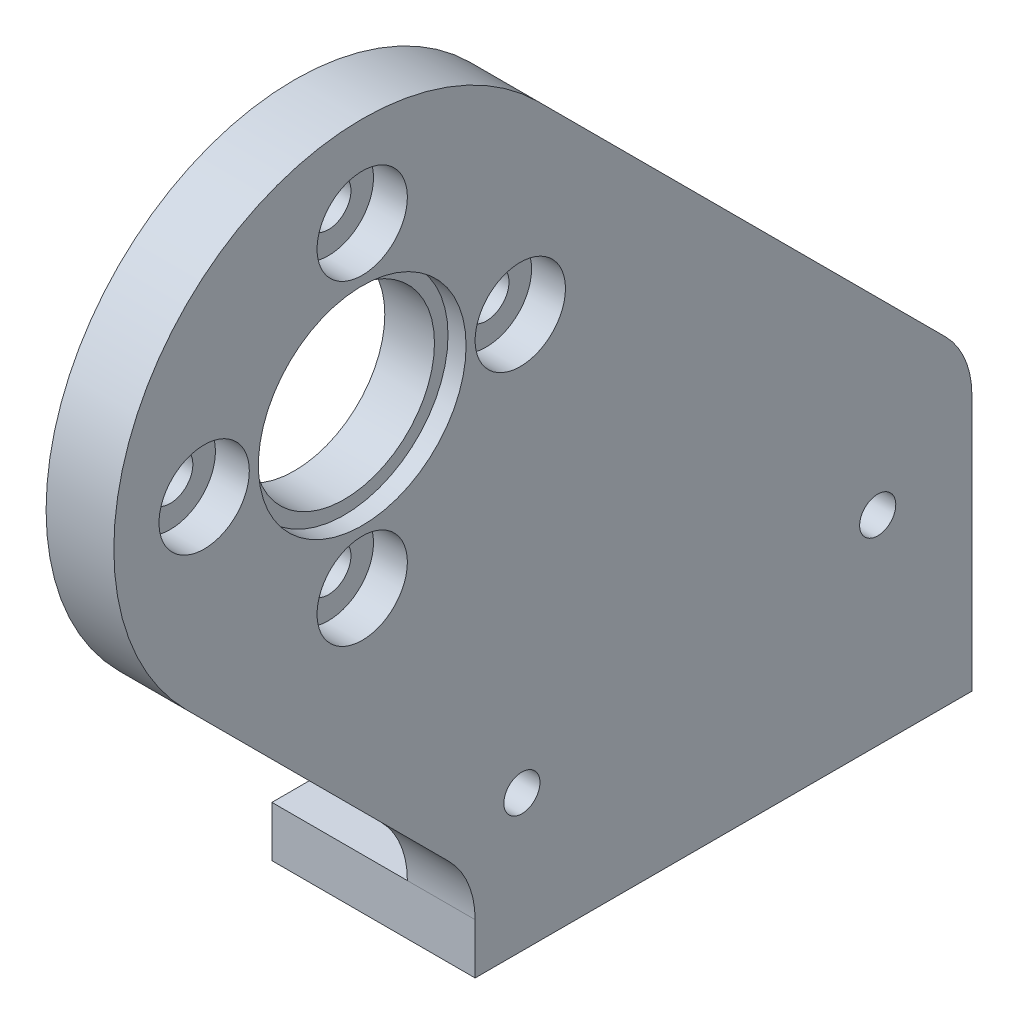
ISO-10303-21;
HEADER;
FILE_DESCRIPTION(('STEP AP214'),'2;1');
FILE_NAME('part.step','',(''),(''),'','','');
FILE_SCHEMA(('AUTOMOTIVE_DESIGN { 1 0 10303 214 1 1 1 1 }'));
ENDSEC;
DATA;
#1=APPLICATION_CONTEXT('core data for automotive mechanical design processes');
#2=APPLICATION_PROTOCOL_DEFINITION('international standard','automotive_design',2000,#1);
#3=PRODUCT_CONTEXT('',#1,'mechanical');
#4=PRODUCT('Part','Part','',(#3));
#5=PRODUCT_RELATED_PRODUCT_CATEGORY('part','',(#4));
#6=PRODUCT_DEFINITION_FORMATION('','',#4);
#7=PRODUCT_DEFINITION_CONTEXT('part definition',#1,'design');
#8=PRODUCT_DEFINITION('design','',#6,#7);
#9=PRODUCT_DEFINITION_SHAPE('','',#8);
#10=(LENGTH_UNIT() NAMED_UNIT(*) SI_UNIT(.MILLI.,.METRE.));
#11=(NAMED_UNIT(*) PLANE_ANGLE_UNIT() SI_UNIT($,.RADIAN.));
#12=(NAMED_UNIT(*) SI_UNIT($,.STERADIAN.) SOLID_ANGLE_UNIT());
#13=UNCERTAINTY_MEASURE_WITH_UNIT(LENGTH_MEASURE(1.E-05),#10,'distance_accuracy_value','');
#14=(GEOMETRIC_REPRESENTATION_CONTEXT(3) GLOBAL_UNCERTAINTY_ASSIGNED_CONTEXT((#13)) GLOBAL_UNIT_ASSIGNED_CONTEXT((#10,
#11,#12)) REPRESENTATION_CONTEXT('',''));
#15=CARTESIAN_POINT('',(0.,0.,0.));
#16=DIRECTION('',(0.,0.,1.));
#17=DIRECTION('',(1.,0.,0.));
#18=AXIS2_PLACEMENT_3D('',#15,#16,#17);
#19=CARTESIAN_POINT('',(69.5,-12.7999999999999,20.9999999999999));
#20=DIRECTION('',(-1.,0.,0.));
#21=DIRECTION('',(0.,0.,1.));
#22=AXIS2_PLACEMENT_3D('',#19,#20,#21);
#23=CYLINDRICAL_SURFACE('',#22,1.);
#24=CARTESIAN_POINT('',(60.,-12.7999999999999,20.9999999999999));
#25=DIRECTION('',(1.,0.,0.));
#26=DIRECTION('',(0.,0.,-1.));
#27=AXIS2_PLACEMENT_3D('',#24,#25,#26);
#28=CIRCLE('',#27,1.);
#29=CARTESIAN_POINT('',(60.,-12.7999999999999,19.9999999999999));
#30=VERTEX_POINT('',#29);
#31=EDGE_CURVE('E42',#30,#30,#28,.F.);
#32=ORIENTED_EDGE('',*,*,#31,.F.);
#33=EDGE_LOOP('',(#32));
#34=FACE_BOUND('',#33,.T.);
#35=CARTESIAN_POINT('',(58.5,-12.7999999999999,20.9999999999999));
#36=DIRECTION('',(-1.,0.,0.));
#37=DIRECTION('',(0.,0.,1.));
#38=AXIS2_PLACEMENT_3D('',#35,#36,#37);
#39=CIRCLE('',#38,1.);
#40=CARTESIAN_POINT('',(58.5,-12.7999999999999,21.9999999999999));
#41=VERTEX_POINT('',#40);
#42=EDGE_CURVE('E269',#41,#41,#39,.T.);
#43=ORIENTED_EDGE('',*,*,#42,.T.);
#44=EDGE_LOOP('',(#43));
#45=FACE_BOUND('',#44,.T.);
#46=ADVANCED_FACE('F38',(#34,#45),#23,.F.);
#47=CARTESIAN_POINT('',(69.5,-5.8,28.));
#48=DIRECTION('',(-1.,0.,0.));
#49=DIRECTION('',(0.,0.,1.));
#50=AXIS2_PLACEMENT_3D('',#47,#48,#49);
#51=CYLINDRICAL_SURFACE('',#50,1.);
#52=CARTESIAN_POINT('',(60.,-5.8,28.));
#53=DIRECTION('',(1.,0.,0.));
#54=DIRECTION('',(0.,0.,-1.));
#55=AXIS2_PLACEMENT_3D('',#52,#53,#54);
#56=CIRCLE('',#55,1.);
#57=CARTESIAN_POINT('',(60.,-5.8,27.));
#58=VERTEX_POINT('',#57);
#59=EDGE_CURVE('E254',#58,#58,#56,.F.);
#60=ORIENTED_EDGE('',*,*,#59,.F.);
#61=EDGE_LOOP('',(#60));
#62=FACE_BOUND('',#61,.T.);
#63=CARTESIAN_POINT('',(58.5,-5.8,28.));
#64=DIRECTION('',(-1.,0.,0.));
#65=DIRECTION('',(0.,0.,1.));
#66=AXIS2_PLACEMENT_3D('',#63,#64,#65);
#67=CIRCLE('',#66,1.);
#68=CARTESIAN_POINT('',(58.5,-5.8,29.));
#69=VERTEX_POINT('',#68);
#70=EDGE_CURVE('E271',#69,#69,#67,.T.);
#71=ORIENTED_EDGE('',*,*,#70,.T.);
#72=EDGE_LOOP('',(#71));
#73=FACE_BOUND('',#72,.T.);
#74=ADVANCED_FACE('F265',(#62,#73),#51,.F.);
#75=CARTESIAN_POINT('',(69.5,1.20000000000005,21.));
#76=DIRECTION('',(-1.,0.,0.));
#77=DIRECTION('',(0.,0.,1.));
#78=AXIS2_PLACEMENT_3D('',#75,#76,#77);
#79=CYLINDRICAL_SURFACE('',#78,1.);
#80=CARTESIAN_POINT('',(60.,1.20000000000005,21.));
#81=DIRECTION('',(1.,0.,0.));
#82=DIRECTION('',(0.,0.,-1.));
#83=AXIS2_PLACEMENT_3D('',#80,#81,#82);
#84=CIRCLE('',#83,1.);
#85=CARTESIAN_POINT('',(60.,1.20000000000005,20.));
#86=VERTEX_POINT('',#85);
#87=EDGE_CURVE('E154',#86,#86,#84,.F.);
#88=ORIENTED_EDGE('',*,*,#87,.F.);
#89=EDGE_LOOP('',(#88));
#90=FACE_BOUND('',#89,.T.);
#91=CARTESIAN_POINT('',(58.5,1.20000000000005,21.));
#92=DIRECTION('',(-1.,0.,0.));
#93=DIRECTION('',(0.,0.,1.));
#94=AXIS2_PLACEMENT_3D('',#91,#92,#93);
#95=CIRCLE('',#94,1.);
#96=CARTESIAN_POINT('',(58.5,1.20000000000005,22.));
#97=VERTEX_POINT('',#96);
#98=EDGE_CURVE('E275',#97,#97,#95,.T.);
#99=ORIENTED_EDGE('',*,*,#98,.T.);
#100=EDGE_LOOP('',(#99));
#101=FACE_BOUND('',#100,.T.);
#102=ADVANCED_FACE('F395',(#90,#101),#79,.F.);
#103=CARTESIAN_POINT('',(69.5,-5.79999999999995,14.));
#104=DIRECTION('',(-1.,0.,0.));
#105=DIRECTION('',(0.,0.,1.));
#106=AXIS2_PLACEMENT_3D('',#103,#104,#105);
#107=CYLINDRICAL_SURFACE('',#106,1.);
#108=CARTESIAN_POINT('',(60.,-5.79999999999995,14.));
#109=DIRECTION('',(1.,0.,0.));
#110=DIRECTION('',(0.,0.,-1.));
#111=AXIS2_PLACEMENT_3D('',#108,#109,#110);
#112=CIRCLE('',#111,1.);
#113=CARTESIAN_POINT('',(60.,-5.79999999999995,13.));
#114=VERTEX_POINT('',#113);
#115=EDGE_CURVE('E172',#114,#114,#112,.F.);
#116=ORIENTED_EDGE('',*,*,#115,.F.);
#117=EDGE_LOOP('',(#116));
#118=FACE_BOUND('',#117,.T.);
#119=CARTESIAN_POINT('',(58.5,-5.79999999999995,14.));
#120=DIRECTION('',(-1.,0.,0.));
#121=DIRECTION('',(0.,0.,1.));
#122=AXIS2_PLACEMENT_3D('',#119,#120,#121);
#123=CIRCLE('',#122,1.);
#124=CARTESIAN_POINT('',(58.5,-5.79999999999995,15.));
#125=VERTEX_POINT('',#124);
#126=EDGE_CURVE('E284',#125,#125,#123,.T.);
#127=ORIENTED_EDGE('',*,*,#126,.T.);
#128=EDGE_LOOP('',(#127));
#129=FACE_BOUND('',#128,.T.);
#130=ADVANCED_FACE('F398',(#118,#129),#107,.F.);
#131=CARTESIAN_POINT('',(60.5,-5.79999999999995,21.));
#132=DIRECTION('',(-1.,0.,0.));
#133=DIRECTION('',(0.,0.,-1.));
#134=AXIS2_PLACEMENT_3D('',#131,#132,#133);
#135=CYLINDRICAL_SURFACE('',#134,4.);
#136=CARTESIAN_POINT('',(60.7,-5.79999999999995,21.));
#137=DIRECTION('',(1.,0.,0.));
#138=DIRECTION('',(0.,0.,-1.));
#139=AXIS2_PLACEMENT_3D('',#136,#137,#138);
#140=CIRCLE('',#139,4.);
#141=CARTESIAN_POINT('',(60.7,-5.79999999999995,17.));
#142=VERTEX_POINT('',#141);
#143=EDGE_CURVE('E179',#142,#142,#140,.F.);
#144=ORIENTED_EDGE('',*,*,#143,.F.);
#145=EDGE_LOOP('',(#144));
#146=FACE_BOUND('',#145,.T.);
#147=CARTESIAN_POINT('',(58.5,-5.79999999999995,21.));
#148=DIRECTION('',(-1.,0.,0.));
#149=DIRECTION('',(0.,0.,1.));
#150=AXIS2_PLACEMENT_3D('',#147,#148,#149);
#151=CIRCLE('',#150,4.);
#152=CARTESIAN_POINT('',(58.5,-5.79999999999995,25.));
#153=VERTEX_POINT('',#152);
#154=EDGE_CURVE('E287',#153,#153,#151,.T.);
#155=ORIENTED_EDGE('',*,*,#154,.T.);
#156=EDGE_LOOP('',(#155));
#157=FACE_BOUND('',#156,.T.);
#158=ADVANCED_FACE('F405',(#146,#157),#135,.F.);
#159=CARTESIAN_POINT('',(61.61096680392,-28.0132034356,20.));
#160=DIRECTION('',(-1.,0.,0.));
#161=DIRECTION('',(0.,-0.707106781186548,0.707106781186548));
#162=AXIS2_PLACEMENT_3D('',#159,#160,#161);
#163=CYLINDRICAL_SURFACE('',#162,4.);
#164=DIRECTION('',(-1.,0.,0.));
#165=VECTOR('',#164,1.);
#166=CARTESIAN_POINT('',(61.5,-25.18477631085,17.171572875254));
#167=LINE('',#166,#165);
#168=CARTESIAN_POINT('',(61.5,-25.18477631085,17.171572875254));
#169=VERTEX_POINT('',#168);
#170=CARTESIAN_POINT('',(58.5,-25.1847763108514,17.1715728752554));
#171=VERTEX_POINT('',#170);
#172=EDGE_CURVE('E117',#169,#171,#167,.T.);
#173=ORIENTED_EDGE('',*,*,#172,.T.);
#174=CARTESIAN_POINT('',(58.5,-28.0132034356,20.));
#175=DIRECTION('',(1.,0.,0.));
#176=DIRECTION('',(0.,0.,1.));
#177=AXIS2_PLACEMENT_3D('',#174,#175,#176);
#178=CIRCLE('',#177,4.00000000000064);
#179=CARTESIAN_POINT('',(58.5,-28.0132034356,16.));
#180=VERTEX_POINT('',#179);
#181=EDGE_CURVE('E120',#180,#171,#178,.T.);
#182=ORIENTED_EDGE('',*,*,#181,.F.);
#183=DIRECTION('',(-1.,0.,0.));
#184=VECTOR('',#183,1.);
#185=CARTESIAN_POINT('',(61.54773426501,-28.0132034356,16.));
#186=LINE('',#185,#184);
#187=CARTESIAN_POINT('',(61.5,-28.0132034356,16.));
#188=VERTEX_POINT('',#187);
#189=EDGE_CURVE('E55',#188,#180,#186,.T.);
#190=ORIENTED_EDGE('',*,*,#189,.F.);
#191=CARTESIAN_POINT('',(61.5,-28.0132034356,20.));
#192=DIRECTION('',(-1.,0.,0.));
#193=DIRECTION('',(0.,0.707106781186548,-0.707106781186548));
#194=AXIS2_PLACEMENT_3D('',#191,#192,#193);
#195=CIRCLE('',#194,4.);
#196=EDGE_CURVE('E11',#169,#188,#195,.T.);
#197=ORIENTED_EDGE('',*,*,#196,.F.);
#198=EDGE_LOOP('',(#173,#182,#190,#197));
#199=FACE_BOUND('',#198,.T.);
#200=ADVANCED_FACE('F119',(#199),#163,.F.);
#201=CARTESIAN_POINT('',(60.93933982822,-28.86066017178,-6.));
#202=DIRECTION('',(0.,0.,-1.));
#203=DIRECTION('',(1.,0.,0.));
#204=AXIS2_PLACEMENT_3D('',#201,#202,#203);
#205=PLANE('',#204);
#206=DIRECTION('',(0.,-1.,2.95824592404915E-13));
#207=VECTOR('',#206,1.);
#208=CARTESIAN_POINT('',(58.5,-18.90050506339,-6.00000000000269));
#209=LINE('',#208,#207);
#210=CARTESIAN_POINT('',(58.5,-18.90050506339,-6.00000000000404));
#211=VERTEX_POINT('',#210);
#212=CARTESIAN_POINT('',(58.5,-28.0132034356,-6.));
#213=VERTEX_POINT('',#212);
#214=EDGE_CURVE('E290',#211,#213,#209,.T.);
#215=ORIENTED_EDGE('',*,*,#214,.F.);
#216=DIRECTION('',(1.,0.,0.));
#217=VECTOR('',#216,1.);
#218=CARTESIAN_POINT('',(59.5,-18.90050506339,-6.));
#219=LINE('',#218,#217);
#220=CARTESIAN_POINT('',(61.5,-18.90050506339,-6.));
#221=VERTEX_POINT('',#220);
#222=EDGE_CURVE('E125',#211,#221,#219,.T.);
#223=ORIENTED_EDGE('',*,*,#222,.T.);
#224=DIRECTION('',(0.,1.,0.));
#225=VECTOR('',#224,1.);
#226=CARTESIAN_POINT('',(61.5,-27.8,-6.));
#227=LINE('',#226,#225);
#228=CARTESIAN_POINT('',(61.5,-30.2494897427832,-6.));
#229=VERTEX_POINT('',#228);
#230=EDGE_CURVE('E47',#229,#221,#227,.T.);
#231=ORIENTED_EDGE('',*,*,#230,.F.);
#232=DIRECTION('',(-1.,0.,0.));
#233=VECTOR('',#232,1.);
#234=CARTESIAN_POINT('',(83.6415947150705,-30.2494897427832,-6.));
#235=LINE('',#234,#233);
#236=CARTESIAN_POINT('',(52.5,-30.2494897427832,-6.));
#237=VERTEX_POINT('',#236);
#238=EDGE_CURVE('E210',#229,#237,#235,.T.);
#239=ORIENTED_EDGE('',*,*,#238,.T.);
#240=DIRECTION('',(0.,-1.,0.));
#241=VECTOR('',#240,1.);
#242=CARTESIAN_POINT('',(52.5,-30.2494897427832,-6.));
#243=LINE('',#242,#241);
#244=CARTESIAN_POINT('',(52.5,-28.0132034356,-6.));
#245=VERTEX_POINT('',#244);
#246=EDGE_CURVE('E198',#245,#237,#243,.T.);
#247=ORIENTED_EDGE('',*,*,#246,.F.);
#248=DIRECTION('',(1.,0.,0.));
#249=VECTOR('',#248,1.);
#250=CARTESIAN_POINT('',(52.5,-28.0132034356,-6.));
#251=LINE('',#250,#249);
#252=EDGE_CURVE('E208',#245,#213,#251,.T.);
#253=ORIENTED_EDGE('',*,*,#252,.T.);
#254=EDGE_LOOP('',(#215,#223,#231,#239,#247,#253));
#255=FACE_BOUND('',#254,.T.);
#256=ADVANCED_FACE('F294',(#255),#205,.T.);
#257=CARTESIAN_POINT('',(60.93933982822,-28.86066017178,16.));
#258=DIRECTION('',(0.,0.,1.));
#259=DIRECTION('',(0.,1.,0.));
#260=AXIS2_PLACEMENT_3D('',#257,#258,#259);
#261=PLANE('',#260);
#262=ORIENTED_EDGE('',*,*,#189,.T.);
#263=DIRECTION('',(1.,0.,0.));
#264=VECTOR('',#263,1.);
#265=CARTESIAN_POINT('',(52.5,-28.0132034356,16.));
#266=LINE('',#265,#264);
#267=CARTESIAN_POINT('',(52.5,-28.0132034356,16.));
#268=VERTEX_POINT('',#267);
#269=EDGE_CURVE('E206',#268,#180,#266,.T.);
#270=ORIENTED_EDGE('',*,*,#269,.F.);
#271=DIRECTION('',(0.,1.,0.));
#272=VECTOR('',#271,1.);
#273=CARTESIAN_POINT('',(52.5,-28.0132034356,16.));
#274=LINE('',#273,#272);
#275=CARTESIAN_POINT('',(52.5,-30.2494897427832,16.));
#276=VERTEX_POINT('',#275);
#277=EDGE_CURVE('E204',#276,#268,#274,.T.);
#278=ORIENTED_EDGE('',*,*,#277,.F.);
#279=DIRECTION('',(-1.,0.,0.));
#280=VECTOR('',#279,1.);
#281=CARTESIAN_POINT('',(83.6415947150705,-30.2494897427832,16.));
#282=LINE('',#281,#280);
#283=CARTESIAN_POINT('',(61.5,-30.2494897427832,16.));
#284=VERTEX_POINT('',#283);
#285=EDGE_CURVE('E211',#284,#276,#282,.T.);
#286=ORIENTED_EDGE('',*,*,#285,.F.);
#287=DIRECTION('',(0.,1.,0.));
#288=VECTOR('',#287,1.);
#289=CARTESIAN_POINT('',(61.5,-28.86066017178,16.));
#290=LINE('',#289,#288);
#291=EDGE_CURVE('E213',#284,#188,#290,.T.);
#292=ORIENTED_EDGE('',*,*,#291,.T.);
#293=EDGE_LOOP('',(#262,#270,#278,#286,#292));
#294=FACE_BOUND('',#293,.T.);
#295=ADVANCED_FACE('F302',(#294),#261,.T.);
#296=CARTESIAN_POINT('',(61.5,-27.8,32.));
#297=DIRECTION('',(1.,0.,0.));
#298=DIRECTION('',(0.,-1.,0.));
#299=AXIS2_PLACEMENT_3D('',#296,#297,#298);
#300=PLANE('',#299);
#301=CARTESIAN_POINT('',(61.5,-12.7999999999999,20.9999999999999));
#302=DIRECTION('',(1.,0.,0.));
#303=DIRECTION('',(0.,0.,-1.));
#304=AXIS2_PLACEMENT_3D('',#301,#302,#303);
#305=CIRCLE('',#304,2.);
#306=CARTESIAN_POINT('',(61.5,-12.7999999999999,18.9999999999999));
#307=VERTEX_POINT('',#306);
#308=EDGE_CURVE('E155',#307,#307,#305,.T.);
#309=ORIENTED_EDGE('',*,*,#308,.F.);
#310=EDGE_LOOP('',(#309));
#311=FACE_BOUND('',#310,.T.);
#312=CARTESIAN_POINT('',(61.5,-5.8,28.));
#313=DIRECTION('',(1.,0.,0.));
#314=DIRECTION('',(0.,0.,-1.));
#315=AXIS2_PLACEMENT_3D('',#312,#313,#314);
#316=CIRCLE('',#315,2.);
#317=CARTESIAN_POINT('',(61.5,-5.8,26.));
#318=VERTEX_POINT('',#317);
#319=EDGE_CURVE('E161',#318,#318,#316,.T.);
#320=ORIENTED_EDGE('',*,*,#319,.F.);
#321=EDGE_LOOP('',(#320));
#322=FACE_BOUND('',#321,.T.);
#323=CARTESIAN_POINT('',(61.5,1.20000000000005,21.));
#324=DIRECTION('',(1.,0.,0.));
#325=DIRECTION('',(0.,0.,-1.));
#326=AXIS2_PLACEMENT_3D('',#323,#324,#325);
#327=CIRCLE('',#326,2.);
#328=CARTESIAN_POINT('',(61.5,1.20000000000005,19.));
#329=VERTEX_POINT('',#328);
#330=EDGE_CURVE('E150',#329,#329,#327,.T.);
#331=ORIENTED_EDGE('',*,*,#330,.F.);
#332=EDGE_LOOP('',(#331));
#333=FACE_BOUND('',#332,.T.);
#334=CARTESIAN_POINT('',(61.5,-5.79999999999995,14.));
#335=DIRECTION('',(1.,0.,0.));
#336=DIRECTION('',(0.,0.,-1.));
#337=AXIS2_PLACEMENT_3D('',#334,#335,#336);
#338=CIRCLE('',#337,2.);
#339=CARTESIAN_POINT('',(61.5,-5.79999999999995,12.));
#340=VERTEX_POINT('',#339);
#341=EDGE_CURVE('E173',#340,#340,#338,.T.);
#342=ORIENTED_EDGE('',*,*,#341,.F.);
#343=EDGE_LOOP('',(#342));
#344=FACE_BOUND('',#343,.T.);
#345=CARTESIAN_POINT('',(61.5,-5.80000000000003,21.0000000000001));
#346=DIRECTION('',(1.,0.,0.));
#347=DIRECTION('',(0.,0.,-1.));
#348=AXIS2_PLACEMENT_3D('',#345,#346,#347);
#349=CIRCLE('',#348,4.6);
#350=CARTESIAN_POINT('',(61.5,-5.80000000000003,16.4000000000001));
#351=VERTEX_POINT('',#350);
#352=EDGE_CURVE('E180',#351,#351,#349,.T.);
#353=ORIENTED_EDGE('',*,*,#352,.F.);
#354=EDGE_LOOP('',(#353));
#355=FACE_BOUND('',#354,.T.);
#356=ORIENTED_EDGE('',*,*,#196,.T.);
#357=ORIENTED_EDGE('',*,*,#291,.F.);
#358=DIRECTION('',(0.,0.,1.));
#359=VECTOR('',#358,1.);
#360=CARTESIAN_POINT('',(61.5,-30.2494897427832,32.));
#361=LINE('',#360,#359);
#362=EDGE_CURVE('E216',#229,#284,#361,.T.);
#363=ORIENTED_EDGE('',*,*,#362,.F.);
#364=ORIENTED_EDGE('',*,*,#230,.T.);
#365=CARTESIAN_POINT('',(61.5,-18.90050506339,-2.));
#366=DIRECTION('',(1.,0.,0.));
#367=DIRECTION('',(0.,0.,-1.));
#368=AXIS2_PLACEMENT_3D('',#365,#366,#367);
#369=CIRCLE('',#368,4.);
#370=CARTESIAN_POINT('',(61.5,-16.07207793864,-4.82842712475));
#371=VERTEX_POINT('',#370);
#372=EDGE_CURVE('E228',#221,#371,#369,.T.);
#373=ORIENTED_EDGE('',*,*,#372,.T.);
#374=DIRECTION('',(0.,-0.707106781186548,-0.707106781186548));
#375=VECTOR('',#374,1.);
#376=CARTESIAN_POINT('',(61.5,1.97817459305205,13.221825406948));
#377=LINE('',#376,#375);
#378=CARTESIAN_POINT('',(61.5,1.97817459305205,13.221825406948));
#379=VERTEX_POINT('',#378);
#380=EDGE_CURVE('E220',#379,#371,#377,.T.);
#381=ORIENTED_EDGE('',*,*,#380,.F.);
#382=CARTESIAN_POINT('',(61.5,-5.79999999999998,21.));
#383=DIRECTION('',(-1.,0.,0.));
#384=DIRECTION('',(0.,0.745298433795883,-0.666731013663985));
#385=AXIS2_PLACEMENT_3D('',#382,#383,#384);
#386=CIRCLE('',#385,11.);
#387=CARTESIAN_POINT('',(61.5,-13.578174593052,28.778174593052));
#388=VERTEX_POINT('',#387);
#389=EDGE_CURVE('E223',#388,#379,#386,.T.);
#390=ORIENTED_EDGE('',*,*,#389,.F.);
#391=DIRECTION('',(0.,0.707106781186548,0.707106781186548));
#392=VECTOR('',#391,1.);
#393=CARTESIAN_POINT('',(61.5,-25.18477631085,17.171572875254));
#394=LINE('',#393,#392);
#395=EDGE_CURVE('E124',#169,#388,#394,.T.);
#396=ORIENTED_EDGE('',*,*,#395,.F.);
#397=EDGE_LOOP('',(#356,#357,#363,#364,#373,#381,#390,#396));
#398=FACE_BOUND('',#397,.T.);
#399=CARTESIAN_POINT('',(61.5,-24.18477631085,13.928932188135));
#400=DIRECTION('',(-1.,0.,0.));
#401=DIRECTION('',(0.,-1.,0.));
#402=AXIS2_PLACEMENT_3D('',#399,#400,#401);
#403=CIRCLE('',#402,0.8);
#404=CARTESIAN_POINT('',(61.5,-24.98477631085,13.928932188135));
#405=VERTEX_POINT('',#404);
#406=EDGE_CURVE('E231',#405,#405,#403,.T.);
#407=ORIENTED_EDGE('',*,*,#406,.T.);
#408=EDGE_LOOP('',(#407));
#409=FACE_BOUND('',#408,.T.);
#410=CARTESIAN_POINT('',(61.5,-21.40640546818,-1.82799186006));
#411=DIRECTION('',(-1.,0.,0.));
#412=DIRECTION('',(0.,-1.,0.));
#413=AXIS2_PLACEMENT_3D('',#410,#411,#412);
#414=CIRCLE('',#413,0.8);
#415=CARTESIAN_POINT('',(61.5,-22.20640546818,-1.82799186006));
#416=VERTEX_POINT('',#415);
#417=EDGE_CURVE('E234',#416,#416,#414,.T.);
#418=ORIENTED_EDGE('',*,*,#417,.T.);
#419=EDGE_LOOP('',(#418));
#420=FACE_BOUND('',#419,.T.);
#421=ADVANCED_FACE('F304',(#311,#322,#333,#344,#355,#398,#409,#420),#300,.T.);
#422=CARTESIAN_POINT('',(59.40518465266,-18.90050506339,-2.));
#423=DIRECTION('',(1.,0.,0.));
#424=DIRECTION('',(0.,0.,1.));
#425=AXIS2_PLACEMENT_3D('',#422,#423,#424);
#426=CYLINDRICAL_SURFACE('',#425,4.);
#427=ORIENTED_EDGE('',*,*,#222,.F.);
#428=CARTESIAN_POINT('',(58.5,-18.90050506339,-2.));
#429=DIRECTION('',(-1.,0.,0.));
#430=DIRECTION('',(0.,0.,1.));
#431=AXIS2_PLACEMENT_3D('',#428,#429,#430);
#432=CIRCLE('',#431,4.00000000000404);
#433=CARTESIAN_POINT('',(58.5,-16.07207793864,-4.82842712475));
#434=VERTEX_POINT('',#433);
#435=EDGE_CURVE('E147',#434,#211,#432,.T.);
#436=ORIENTED_EDGE('',*,*,#435,.F.);
#437=DIRECTION('',(1.,0.,0.));
#438=VECTOR('',#437,1.);
#439=CARTESIAN_POINT('',(59.5,-16.07207793864,-4.82842712475));
#440=LINE('',#439,#438);
#441=EDGE_CURVE('E222',#434,#371,#440,.T.);
#442=ORIENTED_EDGE('',*,*,#441,.T.);
#443=ORIENTED_EDGE('',*,*,#372,.F.);
#444=EDGE_LOOP('',(#427,#436,#442,#443));
#445=FACE_BOUND('',#444,.T.);
#446=ADVANCED_FACE('F310',(#445),#426,.T.);
#447=CARTESIAN_POINT('',(60.5,-7.63273811042195,3.61091270347));
#448=DIRECTION('',(0.,-0.707106781186548,0.707106781186548));
#449=DIRECTION('',(0.,0.707106781186548,0.707106781186548));
#450=AXIS2_PLACEMENT_3D('',#447,#448,#449);
#451=PLANE('',#450);
#452=ORIENTED_EDGE('',*,*,#441,.F.);
#453=DIRECTION('',(0.,-0.707106781186431,-0.707106781186664));
#454=VECTOR('',#453,1.);
#455=CARTESIAN_POINT('',(58.5,1.97817459305204,13.221825406948));
#456=LINE('',#455,#454);
#457=CARTESIAN_POINT('',(58.5,1.97817459305204,13.221825406948));
#458=VERTEX_POINT('',#457);
#459=EDGE_CURVE('E141',#458,#434,#456,.T.);
#460=ORIENTED_EDGE('',*,*,#459,.F.);
#461=DIRECTION('',(-1.,0.,0.));
#462=VECTOR('',#461,1.);
#463=CARTESIAN_POINT('',(61.5,1.97817459305205,13.221825406948));
#464=LINE('',#463,#462);
#465=EDGE_CURVE('E225',#379,#458,#464,.T.);
#466=ORIENTED_EDGE('',*,*,#465,.F.);
#467=ORIENTED_EDGE('',*,*,#380,.T.);
#468=EDGE_LOOP('',(#452,#460,#466,#467));
#469=FACE_BOUND('',#468,.T.);
#470=ADVANCED_FACE('F432',(#469),#451,.F.);
#471=CARTESIAN_POINT('',(60.5,-5.79999999999998,21.));
#472=DIRECTION('',(-1.,0.,0.));
#473=DIRECTION('',(0.,0.,-1.));
#474=AXIS2_PLACEMENT_3D('',#471,#472,#473);
#475=CYLINDRICAL_SURFACE('',#474,11.);
#476=ORIENTED_EDGE('',*,*,#389,.T.);
#477=ORIENTED_EDGE('',*,*,#465,.T.);
#478=CARTESIAN_POINT('',(58.5,-5.79999999999998,21.));
#479=DIRECTION('',(-1.,0.,0.));
#480=DIRECTION('',(0.,0.,1.));
#481=AXIS2_PLACEMENT_3D('',#478,#479,#480);
#482=CIRCLE('',#481,11.);
#483=CARTESIAN_POINT('',(58.5,-13.578174593052,28.778174593052));
#484=VERTEX_POINT('',#483);
#485=EDGE_CURVE('E139',#484,#458,#482,.T.);
#486=ORIENTED_EDGE('',*,*,#485,.F.);
#487=DIRECTION('',(-1.,0.,0.));
#488=VECTOR('',#487,1.);
#489=CARTESIAN_POINT('',(61.5,-13.578174593052,28.778174593052));
#490=LINE('',#489,#488);
#491=EDGE_CURVE('E138',#388,#484,#490,.T.);
#492=ORIENTED_EDGE('',*,*,#491,.F.);
#493=EDGE_LOOP('',(#476,#477,#486,#492));
#494=FACE_BOUND('',#493,.T.);
#495=ADVANCED_FACE('F436',(#494),#475,.T.);
#496=CARTESIAN_POINT('',(60.5,-19.96726188958,22.389087296526));
#497=DIRECTION('',(0.,0.707106781186548,-0.707106781186548));
#498=DIRECTION('',(0.,-0.707106781186548,-0.707106781186548));
#499=AXIS2_PLACEMENT_3D('',#496,#497,#498);
#500=PLANE('',#499);
#501=ORIENTED_EDGE('',*,*,#491,.T.);
#502=DIRECTION('',(0.,0.707106781186603,0.707106781186492));
#503=VECTOR('',#502,1.);
#504=CARTESIAN_POINT('',(58.5,-25.1847763108509,17.1715728752549));
#505=LINE('',#504,#503);
#506=EDGE_CURVE('E133',#171,#484,#505,.T.);
#507=ORIENTED_EDGE('',*,*,#506,.F.);
#508=ORIENTED_EDGE('',*,*,#172,.F.);
#509=ORIENTED_EDGE('',*,*,#395,.T.);
#510=EDGE_LOOP('',(#501,#507,#508,#509));
#511=FACE_BOUND('',#510,.T.);
#512=ADVANCED_FACE('F136',(#511),#500,.F.);
#513=CARTESIAN_POINT('',(59.65,-24.18477631085,13.928932188135));
#514=DIRECTION('',(-1.,0.,0.));
#515=DIRECTION('',(0.,-1.,0.));
#516=AXIS2_PLACEMENT_3D('',#513,#514,#515);
#517=CONICAL_SURFACE('',#516,0.95,0.7853981625);
#518=CARTESIAN_POINT('',(59.5,-24.18477631085,13.928932188135));
#519=DIRECTION('',(-1.,0.,0.));
#520=DIRECTION('',(0.,0.,1.));
#521=AXIS2_PLACEMENT_3D('',#518,#519,#520);
#522=CIRCLE('',#521,1.1);
#523=CARTESIAN_POINT('',(59.5,-24.18477631085,15.028932188135));
#524=VERTEX_POINT('',#523);
#525=EDGE_CURVE('E278',#524,#524,#522,.T.);
#526=ORIENTED_EDGE('',*,*,#525,.T.);
#527=EDGE_LOOP('',(#526));
#528=FACE_BOUND('',#527,.T.);
#529=CARTESIAN_POINT('',(59.8,-24.18477631085,13.928932188135));
#530=DIRECTION('',(-1.,0.,0.));
#531=DIRECTION('',(0.,1.,0.));
#532=AXIS2_PLACEMENT_3D('',#529,#530,#531);
#533=CIRCLE('',#532,0.8);
#534=CARTESIAN_POINT('',(59.8,-23.38477631085,13.928932188135));
#535=VERTEX_POINT('',#534);
#536=EDGE_CURVE('E244',#535,#535,#533,.T.);
#537=ORIENTED_EDGE('',*,*,#536,.F.);
#538=EDGE_LOOP('',(#537));
#539=FACE_BOUND('',#538,.T.);
#540=ADVANCED_FACE('F316',(#528,#539),#517,.F.);
#541=CARTESIAN_POINT('',(62.10472291998,-24.18477631085,13.928932188135));
#542=DIRECTION('',(-1.,0.,0.));
#543=DIRECTION('',(0.,-1.,0.));
#544=AXIS2_PLACEMENT_3D('',#541,#542,#543);
#545=CYLINDRICAL_SURFACE('',#544,0.8);
#546=ORIENTED_EDGE('',*,*,#536,.T.);
#547=EDGE_LOOP('',(#546));
#548=FACE_BOUND('',#547,.T.);
#549=ORIENTED_EDGE('',*,*,#406,.F.);
#550=EDGE_LOOP('',(#549));
#551=FACE_BOUND('',#550,.T.);
#552=ADVANCED_FACE('F319',(#548,#551),#545,.F.);
#553=CARTESIAN_POINT('',(59.65,-21.40640546818,-1.82799186006));
#554=DIRECTION('',(-1.,0.,0.));
#555=DIRECTION('',(0.,-1.,0.));
#556=AXIS2_PLACEMENT_3D('',#553,#554,#555);
#557=CONICAL_SURFACE('',#556,0.95,0.7853981625);
#558=CARTESIAN_POINT('',(59.5,-21.40640546818,-1.82799186006));
#559=DIRECTION('',(-1.,0.,0.));
#560=DIRECTION('',(0.,0.,1.));
#561=AXIS2_PLACEMENT_3D('',#558,#559,#560);
#562=CIRCLE('',#561,1.1);
#563=CARTESIAN_POINT('',(59.5,-21.40640546818,-0.72799186006));
#564=VERTEX_POINT('',#563);
#565=EDGE_CURVE('E334',#564,#564,#562,.T.);
#566=ORIENTED_EDGE('',*,*,#565,.T.);
#567=EDGE_LOOP('',(#566));
#568=FACE_BOUND('',#567,.T.);
#569=CARTESIAN_POINT('',(59.8,-21.40640546818,-1.82799186006));
#570=DIRECTION('',(-1.,0.,0.));
#571=DIRECTION('',(0.,1.,0.));
#572=AXIS2_PLACEMENT_3D('',#569,#570,#571);
#573=CIRCLE('',#572,0.8);
#574=CARTESIAN_POINT('',(59.8,-20.60640546818,-1.82799186006));
#575=VERTEX_POINT('',#574);
#576=EDGE_CURVE('E219',#575,#575,#573,.T.);
#577=ORIENTED_EDGE('',*,*,#576,.F.);
#578=EDGE_LOOP('',(#577));
#579=FACE_BOUND('',#578,.T.);
#580=ADVANCED_FACE('F322',(#568,#579),#557,.F.);
#581=CARTESIAN_POINT('',(62.10472291998,-21.40640546818,-1.82799186006));
#582=DIRECTION('',(-1.,0.,0.));
#583=DIRECTION('',(0.,-1.,0.));
#584=AXIS2_PLACEMENT_3D('',#581,#582,#583);
#585=CYLINDRICAL_SURFACE('',#584,0.8);
#586=ORIENTED_EDGE('',*,*,#576,.T.);
#587=EDGE_LOOP('',(#586));
#588=FACE_BOUND('',#587,.T.);
#589=ORIENTED_EDGE('',*,*,#417,.F.);
#590=EDGE_LOOP('',(#589));
#591=FACE_BOUND('',#590,.T.);
#592=ADVANCED_FACE('F40',(#588,#591),#585,.F.);
#593=CARTESIAN_POINT('',(83.6415947150705,-30.2494897427832,-6.));
#594=DIRECTION('',(0.,-1.,0.));
#595=DIRECTION('',(0.,0.,-1.));
#596=AXIS2_PLACEMENT_3D('',#593,#594,#595);
#597=PLANE('',#596);
#598=CARTESIAN_POINT('',(55.5,-30.2494897427832,13.));
#599=DIRECTION('',(0.,-1.,0.));
#600=DIRECTION('',(0.,0.,-1.));
#601=AXIS2_PLACEMENT_3D('',#598,#599,#600);
#602=CIRCLE('',#601,0.999999999999998);
#603=CARTESIAN_POINT('',(55.5,-30.2494897427832,12.));
#604=VERTEX_POINT('',#603);
#605=EDGE_CURVE('E186',#604,#604,#602,.T.);
#606=ORIENTED_EDGE('',*,*,#605,.F.);
#607=EDGE_LOOP('',(#606));
#608=FACE_BOUND('',#607,.T.);
#609=CARTESIAN_POINT('',(55.5,-30.2494897427832,-3.04196010845019));
#610=DIRECTION('',(0.,-1.,0.));
#611=DIRECTION('',(0.,0.,-1.));
#612=AXIS2_PLACEMENT_3D('',#609,#610,#611);
#613=CIRCLE('',#612,0.999999999999998);
#614=CARTESIAN_POINT('',(55.5,-30.2494897427832,-4.04196010845019));
#615=VERTEX_POINT('',#614);
#616=EDGE_CURVE('E192',#615,#615,#613,.T.);
#617=ORIENTED_EDGE('',*,*,#616,.F.);
#618=EDGE_LOOP('',(#617));
#619=FACE_BOUND('',#618,.T.);
#620=ORIENTED_EDGE('',*,*,#238,.F.);
#621=ORIENTED_EDGE('',*,*,#362,.T.);
#622=ORIENTED_EDGE('',*,*,#285,.T.);
#623=DIRECTION('',(0.,0.,1.));
#624=VECTOR('',#623,1.);
#625=CARTESIAN_POINT('',(52.5,-30.2494897427832,16.));
#626=LINE('',#625,#624);
#627=EDGE_CURVE('E201',#237,#276,#626,.T.);
#628=ORIENTED_EDGE('',*,*,#627,.F.);
#629=EDGE_LOOP('',(#620,#621,#622,#628));
#630=FACE_BOUND('',#629,.T.);
#631=ADVANCED_FACE('F329',(#608,#619,#630),#597,.T.);
#632=CARTESIAN_POINT('',(52.5,-28.0132034356,-6.));
#633=DIRECTION('',(0.,-1.,0.));
#634=DIRECTION('',(0.,0.,-1.));
#635=AXIS2_PLACEMENT_3D('',#632,#633,#634);
#636=PLANE('',#635);
#637=CARTESIAN_POINT('',(55.5,-28.0132034356,13.));
#638=DIRECTION('',(0.,1.,0.));
#639=DIRECTION('',(0.,0.,1.));
#640=AXIS2_PLACEMENT_3D('',#637,#638,#639);
#641=CIRCLE('',#640,0.999999999999998);
#642=CARTESIAN_POINT('',(55.5,-28.0132034356,14.));
#643=VERTEX_POINT('',#642);
#644=EDGE_CURVE('E183',#643,#643,#641,.T.);
#645=ORIENTED_EDGE('',*,*,#644,.F.);
#646=EDGE_LOOP('',(#645));
#647=FACE_BOUND('',#646,.T.);
#648=CARTESIAN_POINT('',(55.5,-28.0132034356,-3.04196010845019));
#649=DIRECTION('',(0.,1.,0.));
#650=DIRECTION('',(0.,0.,1.));
#651=AXIS2_PLACEMENT_3D('',#648,#649,#650);
#652=CIRCLE('',#651,0.999999999999998);
#653=CARTESIAN_POINT('',(55.5,-28.0132034356,-2.04196010845019));
#654=VERTEX_POINT('',#653);
#655=EDGE_CURVE('E189',#654,#654,#652,.T.);
#656=ORIENTED_EDGE('',*,*,#655,.F.);
#657=EDGE_LOOP('',(#656));
#658=FACE_BOUND('',#657,.T.);
#659=ORIENTED_EDGE('',*,*,#269,.T.);
#660=DIRECTION('',(0.,0.,1.));
#661=VECTOR('',#660,1.);
#662=CARTESIAN_POINT('',(58.5,-28.0132034356,-6.));
#663=LINE('',#662,#661);
#664=EDGE_CURVE('E62',#213,#180,#663,.T.);
#665=ORIENTED_EDGE('',*,*,#664,.F.);
#666=ORIENTED_EDGE('',*,*,#252,.F.);
#667=DIRECTION('',(0.,0.,-1.));
#668=VECTOR('',#667,1.);
#669=CARTESIAN_POINT('',(52.5,-28.0132034356,-6.));
#670=LINE('',#669,#668);
#671=EDGE_CURVE('E195',#268,#245,#670,.T.);
#672=ORIENTED_EDGE('',*,*,#671,.F.);
#673=EDGE_LOOP('',(#659,#665,#666,#672));
#674=FACE_BOUND('',#673,.T.);
#675=ADVANCED_FACE('F296',(#647,#658,#674),#636,.F.);
#676=CARTESIAN_POINT('',(52.5,0.,0.));
#677=DIRECTION('',(1.,0.,0.));
#678=DIRECTION('',(0.,0.,-1.));
#679=AXIS2_PLACEMENT_3D('',#676,#677,#678);
#680=PLANE('',#679);
#681=ORIENTED_EDGE('',*,*,#671,.T.);
#682=ORIENTED_EDGE('',*,*,#246,.T.);
#683=ORIENTED_EDGE('',*,*,#627,.T.);
#684=ORIENTED_EDGE('',*,*,#277,.T.);
#685=EDGE_LOOP('',(#681,#682,#683,#684));
#686=FACE_BOUND('',#685,.T.);
#687=ADVANCED_FACE('F298',(#686),#680,.F.);
#688=CARTESIAN_POINT('',(55.5,-34.0132034356,-3.04196010845019));
#689=DIRECTION('',(0.,1.,0.));
#690=DIRECTION('',(0.,0.,1.));
#691=AXIS2_PLACEMENT_3D('',#688,#689,#690);
#692=CYLINDRICAL_SURFACE('',#691,0.999999999999998);
#693=ORIENTED_EDGE('',*,*,#616,.T.);
#694=EDGE_LOOP('',(#693));
#695=FACE_BOUND('',#694,.T.);
#696=ORIENTED_EDGE('',*,*,#655,.T.);
#697=EDGE_LOOP('',(#696));
#698=FACE_BOUND('',#697,.T.);
#699=ADVANCED_FACE('F417',(#695,#698),#692,.F.);
#700=CARTESIAN_POINT('',(55.5,-34.0132034356,13.));
#701=DIRECTION('',(0.,1.,0.));
#702=DIRECTION('',(0.,0.,1.));
#703=AXIS2_PLACEMENT_3D('',#700,#701,#702);
#704=CYLINDRICAL_SURFACE('',#703,0.999999999999998);
#705=ORIENTED_EDGE('',*,*,#605,.T.);
#706=EDGE_LOOP('',(#705));
#707=FACE_BOUND('',#706,.T.);
#708=ORIENTED_EDGE('',*,*,#644,.T.);
#709=EDGE_LOOP('',(#708));
#710=FACE_BOUND('',#709,.T.);
#711=ADVANCED_FACE('F410',(#707,#710),#704,.F.);
#712=CARTESIAN_POINT('',(60.7,-5.80000000000003,21.0000000000001));
#713=DIRECTION('',(1.,0.,0.));
#714=DIRECTION('',(0.,0.,-1.));
#715=AXIS2_PLACEMENT_3D('',#712,#713,#714);
#716=PLANE('',#715);
#717=CARTESIAN_POINT('',(60.7,-5.80000000000003,21.0000000000001));
#718=DIRECTION('',(1.,0.,0.));
#719=DIRECTION('',(0.,0.,-1.));
#720=AXIS2_PLACEMENT_3D('',#717,#718,#719);
#721=CIRCLE('',#720,4.6);
#722=CARTESIAN_POINT('',(60.7,-5.80000000000003,16.4000000000001));
#723=VERTEX_POINT('',#722);
#724=EDGE_CURVE('E176',#723,#723,#721,.T.);
#725=ORIENTED_EDGE('',*,*,#724,.T.);
#726=EDGE_LOOP('',(#725));
#727=FACE_BOUND('',#726,.T.);
#728=ORIENTED_EDGE('',*,*,#143,.T.);
#729=EDGE_LOOP('',(#728));
#730=FACE_BOUND('',#729,.T.);
#731=ADVANCED_FACE('F407',(#727,#730),#716,.T.);
#732=CARTESIAN_POINT('',(60.7,-5.80000000000003,21.0000000000001));
#733=DIRECTION('',(1.,0.,0.));
#734=DIRECTION('',(0.,0.,-1.));
#735=AXIS2_PLACEMENT_3D('',#732,#733,#734);
#736=CYLINDRICAL_SURFACE('',#735,4.6);
#737=ORIENTED_EDGE('',*,*,#724,.F.);
#738=EDGE_LOOP('',(#737));
#739=FACE_BOUND('',#738,.T.);
#740=ORIENTED_EDGE('',*,*,#352,.T.);
#741=EDGE_LOOP('',(#740));
#742=FACE_BOUND('',#741,.T.);
#743=ADVANCED_FACE('F390',(#739,#742),#736,.F.);
#744=CARTESIAN_POINT('',(60.,-5.79999999999995,14.));
#745=DIRECTION('',(1.,0.,0.));
#746=DIRECTION('',(0.,0.,-1.));
#747=AXIS2_PLACEMENT_3D('',#744,#745,#746);
#748=PLANE('',#747);
#749=CARTESIAN_POINT('',(60.,-5.79999999999995,14.));
#750=DIRECTION('',(1.,0.,0.));
#751=DIRECTION('',(0.,0.,-1.));
#752=AXIS2_PLACEMENT_3D('',#749,#750,#751);
#753=CIRCLE('',#752,2.);
#754=CARTESIAN_POINT('',(60.,-5.79999999999995,12.));
#755=VERTEX_POINT('',#754);
#756=EDGE_CURVE('E169',#755,#755,#753,.T.);
#757=ORIENTED_EDGE('',*,*,#756,.T.);
#758=EDGE_LOOP('',(#757));
#759=FACE_BOUND('',#758,.T.);
#760=ORIENTED_EDGE('',*,*,#115,.T.);
#761=EDGE_LOOP('',(#760));
#762=FACE_BOUND('',#761,.T.);
#763=ADVANCED_FACE('F387',(#759,#762),#748,.T.);
#764=CARTESIAN_POINT('',(60.,-5.79999999999995,14.));
#765=DIRECTION('',(1.,0.,0.));
#766=DIRECTION('',(0.,0.,-1.));
#767=AXIS2_PLACEMENT_3D('',#764,#765,#766);
#768=CYLINDRICAL_SURFACE('',#767,2.);
#769=ORIENTED_EDGE('',*,*,#756,.F.);
#770=EDGE_LOOP('',(#769));
#771=FACE_BOUND('',#770,.T.);
#772=ORIENTED_EDGE('',*,*,#341,.T.);
#773=EDGE_LOOP('',(#772));
#774=FACE_BOUND('',#773,.T.);
#775=ADVANCED_FACE('F382',(#771,#774),#768,.F.);
#776=CARTESIAN_POINT('',(60.,1.20000000000005,21.));
#777=DIRECTION('',(1.,0.,0.));
#778=DIRECTION('',(0.,0.,-1.));
#779=AXIS2_PLACEMENT_3D('',#776,#777,#778);
#780=PLANE('',#779);
#781=CARTESIAN_POINT('',(60.,1.20000000000005,21.));
#782=DIRECTION('',(1.,0.,0.));
#783=DIRECTION('',(0.,0.,-1.));
#784=AXIS2_PLACEMENT_3D('',#781,#782,#783);
#785=CIRCLE('',#784,2.);
#786=CARTESIAN_POINT('',(60.,1.20000000000005,19.));
#787=VERTEX_POINT('',#786);
#788=EDGE_CURVE('E164',#787,#787,#785,.T.);
#789=ORIENTED_EDGE('',*,*,#788,.T.);
#790=EDGE_LOOP('',(#789));
#791=FACE_BOUND('',#790,.T.);
#792=ORIENTED_EDGE('',*,*,#87,.T.);
#793=EDGE_LOOP('',(#792));
#794=FACE_BOUND('',#793,.T.);
#795=ADVANCED_FACE('F379',(#791,#794),#780,.T.);
#796=CARTESIAN_POINT('',(60.,1.20000000000005,21.));
#797=DIRECTION('',(1.,0.,0.));
#798=DIRECTION('',(0.,0.,-1.));
#799=AXIS2_PLACEMENT_3D('',#796,#797,#798);
#800=CYLINDRICAL_SURFACE('',#799,2.);
#801=ORIENTED_EDGE('',*,*,#788,.F.);
#802=EDGE_LOOP('',(#801));
#803=FACE_BOUND('',#802,.T.);
#804=ORIENTED_EDGE('',*,*,#330,.T.);
#805=EDGE_LOOP('',(#804));
#806=FACE_BOUND('',#805,.T.);
#807=ADVANCED_FACE('F374',(#803,#806),#800,.F.);
#808=CARTESIAN_POINT('',(60.,-5.8,28.));
#809=DIRECTION('',(1.,0.,0.));
#810=DIRECTION('',(0.,0.,-1.));
#811=AXIS2_PLACEMENT_3D('',#808,#809,#810);
#812=PLANE('',#811);
#813=CARTESIAN_POINT('',(60.,-5.8,28.));
#814=DIRECTION('',(1.,0.,0.));
#815=DIRECTION('',(0.,0.,-1.));
#816=AXIS2_PLACEMENT_3D('',#813,#814,#815);
#817=CIRCLE('',#816,2.);
#818=CARTESIAN_POINT('',(60.,-5.8,26.));
#819=VERTEX_POINT('',#818);
#820=EDGE_CURVE('E158',#819,#819,#817,.T.);
#821=ORIENTED_EDGE('',*,*,#820,.T.);
#822=EDGE_LOOP('',(#821));
#823=FACE_BOUND('',#822,.T.);
#824=ORIENTED_EDGE('',*,*,#59,.T.);
#825=EDGE_LOOP('',(#824));
#826=FACE_BOUND('',#825,.T.);
#827=ADVANCED_FACE('F371',(#823,#826),#812,.T.);
#828=CARTESIAN_POINT('',(60.,-5.8,28.));
#829=DIRECTION('',(1.,0.,0.));
#830=DIRECTION('',(0.,0.,-1.));
#831=AXIS2_PLACEMENT_3D('',#828,#829,#830);
#832=CYLINDRICAL_SURFACE('',#831,2.);
#833=ORIENTED_EDGE('',*,*,#820,.F.);
#834=EDGE_LOOP('',(#833));
#835=FACE_BOUND('',#834,.T.);
#836=ORIENTED_EDGE('',*,*,#319,.T.);
#837=EDGE_LOOP('',(#836));
#838=FACE_BOUND('',#837,.T.);
#839=ADVANCED_FACE('F366',(#835,#838),#832,.F.);
#840=CARTESIAN_POINT('',(60.,-12.7999999999999,20.9999999999999));
#841=DIRECTION('',(1.,0.,0.));
#842=DIRECTION('',(0.,0.,-1.));
#843=AXIS2_PLACEMENT_3D('',#840,#841,#842);
#844=PLANE('',#843);
#845=CARTESIAN_POINT('',(60.,-12.7999999999999,20.9999999999999));
#846=DIRECTION('',(1.,0.,0.));
#847=DIRECTION('',(0.,0.,-1.));
#848=AXIS2_PLACEMENT_3D('',#845,#846,#847);
#849=CIRCLE('',#848,2.);
#850=CARTESIAN_POINT('',(60.,-12.7999999999999,18.9999999999999));
#851=VERTEX_POINT('',#850);
#852=EDGE_CURVE('E151',#851,#851,#849,.T.);
#853=ORIENTED_EDGE('',*,*,#852,.T.);
#854=EDGE_LOOP('',(#853));
#855=FACE_BOUND('',#854,.T.);
#856=ORIENTED_EDGE('',*,*,#31,.T.);
#857=EDGE_LOOP('',(#856));
#858=FACE_BOUND('',#857,.T.);
#859=ADVANCED_FACE('F261',(#855,#858),#844,.T.);
#860=CARTESIAN_POINT('',(60.,-12.7999999999999,20.9999999999999));
#861=DIRECTION('',(1.,0.,0.));
#862=DIRECTION('',(0.,0.,-1.));
#863=AXIS2_PLACEMENT_3D('',#860,#861,#862);
#864=CYLINDRICAL_SURFACE('',#863,2.);
#865=ORIENTED_EDGE('',*,*,#852,.F.);
#866=EDGE_LOOP('',(#865));
#867=FACE_BOUND('',#866,.T.);
#868=ORIENTED_EDGE('',*,*,#308,.T.);
#869=EDGE_LOOP('',(#868));
#870=FACE_BOUND('',#869,.T.);
#871=ADVANCED_FACE('F360',(#867,#870),#864,.F.);
#872=CARTESIAN_POINT('',(58.5,-28.0132034356,20.));
#873=DIRECTION('',(-1.,0.,0.));
#874=DIRECTION('',(0.,0.,1.));
#875=AXIS2_PLACEMENT_3D('',#872,#873,#874);
#876=PLANE('',#875);
#877=CARTESIAN_POINT('',(58.5,-24.18477631085,13.928932188135));
#878=DIRECTION('',(-1.,0.,0.));
#879=DIRECTION('',(0.,0.,1.));
#880=AXIS2_PLACEMENT_3D('',#877,#878,#879);
#881=CIRCLE('',#880,1.1);
#882=CARTESIAN_POINT('',(58.5,-24.18477631085,15.028932188135));
#883=VERTEX_POINT('',#882);
#884=EDGE_CURVE('E272',#883,#883,#881,.T.);
#885=ORIENTED_EDGE('',*,*,#884,.F.);
#886=EDGE_LOOP('',(#885));
#887=FACE_BOUND('',#886,.T.);
#888=ORIENTED_EDGE('',*,*,#70,.F.);
#889=EDGE_LOOP('',(#888));
#890=FACE_BOUND('',#889,.T.);
#891=ORIENTED_EDGE('',*,*,#126,.F.);
#892=EDGE_LOOP('',(#891));
#893=FACE_BOUND('',#892,.T.);
#894=ORIENTED_EDGE('',*,*,#214,.T.);
#895=ORIENTED_EDGE('',*,*,#664,.T.);
#896=ORIENTED_EDGE('',*,*,#181,.T.);
#897=ORIENTED_EDGE('',*,*,#506,.T.);
#898=ORIENTED_EDGE('',*,*,#485,.T.);
#899=ORIENTED_EDGE('',*,*,#459,.T.);
#900=ORIENTED_EDGE('',*,*,#435,.T.);
#901=EDGE_LOOP('',(#894,#895,#896,#897,#898,#899,#900));
#902=FACE_BOUND('',#901,.T.);
#903=ORIENTED_EDGE('',*,*,#154,.F.);
#904=EDGE_LOOP('',(#903));
#905=FACE_BOUND('',#904,.T.);
#906=ORIENTED_EDGE('',*,*,#98,.F.);
#907=EDGE_LOOP('',(#906));
#908=FACE_BOUND('',#907,.T.);
#909=ORIENTED_EDGE('',*,*,#42,.F.);
#910=EDGE_LOOP('',(#909));
#911=FACE_BOUND('',#910,.T.);
#912=CARTESIAN_POINT('',(58.5,-21.40640546818,-1.82799186006));
#913=DIRECTION('',(-1.,0.,0.));
#914=DIRECTION('',(0.,0.,1.));
#915=AXIS2_PLACEMENT_3D('',#912,#913,#914);
#916=CIRCLE('',#915,1.1);
#917=CARTESIAN_POINT('',(58.5,-21.40640546818,-0.72799186006));
#918=VERTEX_POINT('',#917);
#919=EDGE_CURVE('E340',#918,#918,#916,.T.);
#920=ORIENTED_EDGE('',*,*,#919,.F.);
#921=EDGE_LOOP('',(#920));
#922=FACE_BOUND('',#921,.T.);
#923=ADVANCED_FACE('F130',(#887,#890,#893,#902,#905,#908,#911,#922),#876,.T.);
#924=CARTESIAN_POINT('',(58.5,-24.18477631085,13.928932188135));
#925=DIRECTION('',(1.,0.,0.));
#926=DIRECTION('',(0.,0.,-1.));
#927=AXIS2_PLACEMENT_3D('',#924,#925,#926);
#928=CYLINDRICAL_SURFACE('',#927,1.1);
#929=ORIENTED_EDGE('',*,*,#884,.T.);
#930=EDGE_LOOP('',(#929));
#931=FACE_BOUND('',#930,.T.);
#932=ORIENTED_EDGE('',*,*,#525,.F.);
#933=EDGE_LOOP('',(#932));
#934=FACE_BOUND('',#933,.T.);
#935=ADVANCED_FACE('F350',(#931,#934),#928,.F.);
#936=CARTESIAN_POINT('',(58.5,-21.40640546818,-1.82799186006));
#937=DIRECTION('',(1.,0.,0.));
#938=DIRECTION('',(0.,0.,-1.));
#939=AXIS2_PLACEMENT_3D('',#936,#937,#938);
#940=CYLINDRICAL_SURFACE('',#939,1.1);
#941=ORIENTED_EDGE('',*,*,#919,.T.);
#942=EDGE_LOOP('',(#941));
#943=FACE_BOUND('',#942,.T.);
#944=ORIENTED_EDGE('',*,*,#565,.F.);
#945=EDGE_LOOP('',(#944));
#946=FACE_BOUND('',#945,.T.);
#947=ADVANCED_FACE('F352',(#943,#946),#940,.F.);
#948=CLOSED_SHELL('',(#46,#74,#102,#130,#158,#200,#256,#295,#421,#446,#470,#495,#512,#540,#552,
#580,#592,#631,#675,#687,#699,#711,#731,#743,#763,#775,#795,#807,#827,#839,#859,#871,#923,#935,#947));
#949=MANIFOLD_SOLID_BREP('B2',#948);
#950=ADVANCED_BREP_SHAPE_REPRESENTATION('',(#18,#949),#14);
#951=SHAPE_DEFINITION_REPRESENTATION(#9,#950);
ENDSEC;
END-ISO-10303-21;
